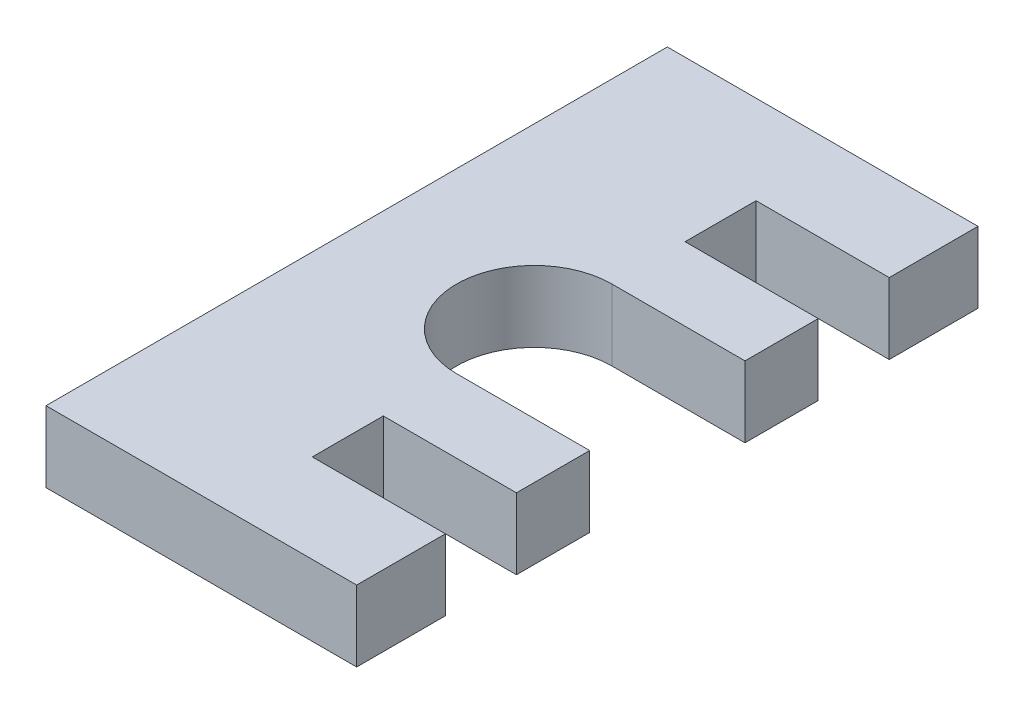
ISO-10303-21;
HEADER;
FILE_DESCRIPTION(('STEP AP214'),'2;1');
FILE_NAME('part.step','',(''),(''),'','','');
FILE_SCHEMA(('AUTOMOTIVE_DESIGN { 1 0 10303 214 1 1 1 1 }'));
ENDSEC;
DATA;
#1=APPLICATION_CONTEXT('core data for automotive mechanical design processes');
#2=APPLICATION_PROTOCOL_DEFINITION('international standard','automotive_design',2000,#1);
#3=PRODUCT_CONTEXT('',#1,'mechanical');
#4=PRODUCT('Part','Part','',(#3));
#5=PRODUCT_RELATED_PRODUCT_CATEGORY('part','',(#4));
#6=PRODUCT_DEFINITION_FORMATION('','',#4);
#7=PRODUCT_DEFINITION_CONTEXT('part definition',#1,'design');
#8=PRODUCT_DEFINITION('design','',#6,#7);
#9=PRODUCT_DEFINITION_SHAPE('','',#8);
#10=(LENGTH_UNIT() NAMED_UNIT(*) SI_UNIT(.MILLI.,.METRE.));
#11=(NAMED_UNIT(*) PLANE_ANGLE_UNIT() SI_UNIT($,.RADIAN.));
#12=(NAMED_UNIT(*) SI_UNIT($,.STERADIAN.) SOLID_ANGLE_UNIT());
#13=UNCERTAINTY_MEASURE_WITH_UNIT(LENGTH_MEASURE(1.E-05),#10,'distance_accuracy_value','');
#14=(GEOMETRIC_REPRESENTATION_CONTEXT(3) GLOBAL_UNCERTAINTY_ASSIGNED_CONTEXT((#13)) GLOBAL_UNIT_ASSIGNED_CONTEXT((#10,
#11,#12)) REPRESENTATION_CONTEXT('',''));
#15=CARTESIAN_POINT('',(0.,0.,0.));
#16=DIRECTION('',(0.,0.,1.));
#17=DIRECTION('',(1.,0.,0.));
#18=AXIS2_PLACEMENT_3D('',#15,#16,#17);
#19=CARTESIAN_POINT('',(22.225,5.08,22.225));
#20=DIRECTION('',(0.,0.,-1.));
#21=DIRECTION('',(-1.,0.,0.));
#22=AXIS2_PLACEMENT_3D('',#19,#20,#21);
#23=PLANE('',#22);
#24=DIRECTION('',(1.,0.,0.));
#25=VECTOR('',#24,1.);
#26=CARTESIAN_POINT('',(22.225,0.,22.225));
#27=LINE('',#26,#25);
#28=CARTESIAN_POINT('',(0.,0.,22.225));
#29=VERTEX_POINT('',#28);
#30=CARTESIAN_POINT('',(22.225,0.,22.225));
#31=VERTEX_POINT('',#30);
#32=EDGE_CURVE('E196',#29,#31,#27,.T.);
#33=ORIENTED_EDGE('',*,*,#32,.T.);
#34=DIRECTION('',(0.,-1.,0.));
#35=VECTOR('',#34,1.);
#36=CARTESIAN_POINT('',(22.225,5.08,22.225));
#37=LINE('',#36,#35);
#38=CARTESIAN_POINT('',(22.225,5.08,22.225));
#39=VERTEX_POINT('',#38);
#40=EDGE_CURVE('E52',#39,#31,#37,.T.);
#41=ORIENTED_EDGE('',*,*,#40,.F.);
#42=DIRECTION('',(1.,0.,0.));
#43=VECTOR('',#42,1.);
#44=CARTESIAN_POINT('',(22.225,5.08,22.225));
#45=LINE('',#44,#43);
#46=CARTESIAN_POINT('',(0.,5.08,22.225));
#47=VERTEX_POINT('',#46);
#48=EDGE_CURVE('E128',#47,#39,#45,.T.);
#49=ORIENTED_EDGE('',*,*,#48,.F.);
#50=DIRECTION('',(0.,-1.,0.));
#51=VECTOR('',#50,1.);
#52=CARTESIAN_POINT('',(0.,5.08,22.225));
#53=LINE('',#52,#51);
#54=EDGE_CURVE('E11',#47,#29,#53,.T.);
#55=ORIENTED_EDGE('',*,*,#54,.T.);
#56=EDGE_LOOP('',(#33,#41,#49,#55));
#57=FACE_BOUND('',#56,.T.);
#58=ADVANCED_FACE('F43',(#57),#23,.F.);
#59=CARTESIAN_POINT('',(22.225,5.08,22.225));
#60=DIRECTION('',(-1.,0.,0.));
#61=DIRECTION('',(0.,0.,1.));
#62=AXIS2_PLACEMENT_3D('',#59,#60,#61);
#63=PLANE('',#62);
#64=DIRECTION('',(0.,0.,-1.));
#65=VECTOR('',#64,1.);
#66=CARTESIAN_POINT('',(22.225,0.,22.225));
#67=LINE('',#66,#65);
#68=CARTESIAN_POINT('',(22.225,0.,15.875));
#69=VERTEX_POINT('',#68);
#70=EDGE_CURVE('E199',#31,#69,#67,.T.);
#71=ORIENTED_EDGE('',*,*,#70,.T.);
#72=DIRECTION('',(0.,-1.,0.));
#73=VECTOR('',#72,1.);
#74=CARTESIAN_POINT('',(22.225,5.08,15.875));
#75=LINE('',#74,#73);
#76=CARTESIAN_POINT('',(22.225,5.08,15.875));
#77=VERTEX_POINT('',#76);
#78=EDGE_CURVE('E283',#77,#69,#75,.T.);
#79=ORIENTED_EDGE('',*,*,#78,.F.);
#80=DIRECTION('',(0.,0.,-1.));
#81=VECTOR('',#80,1.);
#82=CARTESIAN_POINT('',(22.225,5.08,22.225));
#83=LINE('',#82,#81);
#84=EDGE_CURVE('E293',#39,#77,#83,.T.);
#85=ORIENTED_EDGE('',*,*,#84,.F.);
#86=ORIENTED_EDGE('',*,*,#40,.T.);
#87=EDGE_LOOP('',(#71,#79,#85,#86));
#88=FACE_BOUND('',#87,.T.);
#89=ADVANCED_FACE('F291',(#88),#63,.F.);
#90=CARTESIAN_POINT('',(22.225,5.08,15.875));
#91=DIRECTION('',(0.,0.,1.));
#92=DIRECTION('',(1.,0.,0.));
#93=AXIS2_PLACEMENT_3D('',#90,#91,#92);
#94=PLANE('',#93);
#95=DIRECTION('',(-1.,0.,0.));
#96=VECTOR('',#95,1.);
#97=CARTESIAN_POINT('',(22.225,0.,15.875));
#98=LINE('',#97,#96);
#99=CARTESIAN_POINT('',(12.7,0.,15.875));
#100=VERTEX_POINT('',#99);
#101=EDGE_CURVE('E202',#69,#100,#98,.T.);
#102=ORIENTED_EDGE('',*,*,#101,.T.);
#103=DIRECTION('',(0.,-1.,0.));
#104=VECTOR('',#103,1.);
#105=CARTESIAN_POINT('',(12.7,5.08,15.875));
#106=LINE('',#105,#104);
#107=CARTESIAN_POINT('',(12.7,5.08,15.875));
#108=VERTEX_POINT('',#107);
#109=EDGE_CURVE('E279',#108,#100,#106,.T.);
#110=ORIENTED_EDGE('',*,*,#109,.F.);
#111=DIRECTION('',(-1.,0.,0.));
#112=VECTOR('',#111,1.);
#113=CARTESIAN_POINT('',(22.225,5.08,15.875));
#114=LINE('',#113,#112);
#115=EDGE_CURVE('E313',#77,#108,#114,.T.);
#116=ORIENTED_EDGE('',*,*,#115,.F.);
#117=ORIENTED_EDGE('',*,*,#78,.T.);
#118=EDGE_LOOP('',(#102,#110,#116,#117));
#119=FACE_BOUND('',#118,.T.);
#120=ADVANCED_FACE('F303',(#119),#94,.F.);
#121=CARTESIAN_POINT('',(12.7,5.08,15.875));
#122=DIRECTION('',(-1.,0.,0.));
#123=DIRECTION('',(0.,0.,1.));
#124=AXIS2_PLACEMENT_3D('',#121,#122,#123);
#125=PLANE('',#124);
#126=DIRECTION('',(0.,0.,-1.));
#127=VECTOR('',#126,1.);
#128=CARTESIAN_POINT('',(12.7,0.,15.875));
#129=LINE('',#128,#127);
#130=CARTESIAN_POINT('',(12.7,0.,10.795));
#131=VERTEX_POINT('',#130);
#132=EDGE_CURVE('E205',#100,#131,#129,.T.);
#133=ORIENTED_EDGE('',*,*,#132,.T.);
#134=DIRECTION('',(0.,-1.,0.));
#135=VECTOR('',#134,1.);
#136=CARTESIAN_POINT('',(12.7,5.08,10.795));
#137=LINE('',#136,#135);
#138=CARTESIAN_POINT('',(12.7,5.08,10.795));
#139=VERTEX_POINT('',#138);
#140=EDGE_CURVE('E275',#139,#131,#137,.T.);
#141=ORIENTED_EDGE('',*,*,#140,.F.);
#142=DIRECTION('',(0.,0.,-1.));
#143=VECTOR('',#142,1.);
#144=CARTESIAN_POINT('',(12.7,5.08,15.875));
#145=LINE('',#144,#143);
#146=EDGE_CURVE('E309',#108,#139,#145,.T.);
#147=ORIENTED_EDGE('',*,*,#146,.F.);
#148=ORIENTED_EDGE('',*,*,#109,.T.);
#149=EDGE_LOOP('',(#133,#141,#147,#148));
#150=FACE_BOUND('',#149,.T.);
#151=ADVANCED_FACE('F307',(#150),#125,.F.);
#152=CARTESIAN_POINT('',(12.7,5.08,10.795));
#153=DIRECTION('',(0.,0.,-1.));
#154=DIRECTION('',(-1.,0.,0.));
#155=AXIS2_PLACEMENT_3D('',#152,#153,#154);
#156=PLANE('',#155);
#157=DIRECTION('',(1.,0.,0.));
#158=VECTOR('',#157,1.);
#159=CARTESIAN_POINT('',(12.7,0.,10.795));
#160=LINE('',#159,#158);
#161=CARTESIAN_POINT('',(22.225,0.,10.795));
#162=VERTEX_POINT('',#161);
#163=EDGE_CURVE('E208',#131,#162,#160,.T.);
#164=ORIENTED_EDGE('',*,*,#163,.T.);
#165=DIRECTION('',(0.,-1.,0.));
#166=VECTOR('',#165,1.);
#167=CARTESIAN_POINT('',(22.225,5.08,10.795));
#168=LINE('',#167,#166);
#169=CARTESIAN_POINT('',(22.225,5.08,10.795));
#170=VERTEX_POINT('',#169);
#171=EDGE_CURVE('E271',#170,#162,#168,.T.);
#172=ORIENTED_EDGE('',*,*,#171,.F.);
#173=DIRECTION('',(1.,0.,0.));
#174=VECTOR('',#173,1.);
#175=CARTESIAN_POINT('',(12.7,5.08,10.795));
#176=LINE('',#175,#174);
#177=EDGE_CURVE('E312',#139,#170,#176,.T.);
#178=ORIENTED_EDGE('',*,*,#177,.F.);
#179=ORIENTED_EDGE('',*,*,#140,.T.);
#180=EDGE_LOOP('',(#164,#172,#178,#179));
#181=FACE_BOUND('',#180,.T.);
#182=ADVANCED_FACE('F375',(#181),#156,.F.);
#183=CARTESIAN_POINT('',(22.225,5.08,10.795));
#184=DIRECTION('',(-1.,0.,0.));
#185=DIRECTION('',(0.,0.,1.));
#186=AXIS2_PLACEMENT_3D('',#183,#184,#185);
#187=PLANE('',#186);
#188=DIRECTION('',(0.,0.,-1.));
#189=VECTOR('',#188,1.);
#190=CARTESIAN_POINT('',(22.225,0.,10.795));
#191=LINE('',#190,#189);
#192=CARTESIAN_POINT('',(22.225,0.,5.55625));
#193=VERTEX_POINT('',#192);
#194=EDGE_CURVE('E211',#162,#193,#191,.T.);
#195=ORIENTED_EDGE('',*,*,#194,.T.);
#196=DIRECTION('',(0.,-1.,0.));
#197=VECTOR('',#196,1.);
#198=CARTESIAN_POINT('',(22.225,5.08,5.55625));
#199=LINE('',#198,#197);
#200=CARTESIAN_POINT('',(22.225,5.08,5.55625));
#201=VERTEX_POINT('',#200);
#202=EDGE_CURVE('E267',#201,#193,#199,.T.);
#203=ORIENTED_EDGE('',*,*,#202,.F.);
#204=DIRECTION('',(0.,0.,-1.));
#205=VECTOR('',#204,1.);
#206=CARTESIAN_POINT('',(22.225,5.08,10.795));
#207=LINE('',#206,#205);
#208=EDGE_CURVE('E317',#170,#201,#207,.T.);
#209=ORIENTED_EDGE('',*,*,#208,.F.);
#210=ORIENTED_EDGE('',*,*,#171,.T.);
#211=EDGE_LOOP('',(#195,#203,#209,#210));
#212=FACE_BOUND('',#211,.T.);
#213=ADVANCED_FACE('F378',(#212),#187,.F.);
#214=CARTESIAN_POINT('',(22.225,5.08,5.55625));
#215=DIRECTION('',(0.,0.,1.));
#216=DIRECTION('',(1.,0.,0.));
#217=AXIS2_PLACEMENT_3D('',#214,#215,#216);
#218=PLANE('',#217);
#219=DIRECTION('',(-1.,0.,0.));
#220=VECTOR('',#219,1.);
#221=CARTESIAN_POINT('',(22.225,0.,5.55625));
#222=LINE('',#221,#220);
#223=CARTESIAN_POINT('',(12.7,0.,5.55625));
#224=VERTEX_POINT('',#223);
#225=EDGE_CURVE('E214',#193,#224,#222,.T.);
#226=ORIENTED_EDGE('',*,*,#225,.T.);
#227=DIRECTION('',(0.,-1.,0.));
#228=VECTOR('',#227,1.);
#229=CARTESIAN_POINT('',(12.7,5.08,5.55625));
#230=LINE('',#229,#228);
#231=CARTESIAN_POINT('',(12.7,5.08,5.55625));
#232=VERTEX_POINT('',#231);
#233=EDGE_CURVE('E263',#232,#224,#230,.T.);
#234=ORIENTED_EDGE('',*,*,#233,.F.);
#235=DIRECTION('',(-1.,0.,0.));
#236=VECTOR('',#235,1.);
#237=CARTESIAN_POINT('',(22.225,5.08,5.55625));
#238=LINE('',#237,#236);
#239=EDGE_CURVE('E324',#201,#232,#238,.T.);
#240=ORIENTED_EDGE('',*,*,#239,.F.);
#241=ORIENTED_EDGE('',*,*,#202,.T.);
#242=EDGE_LOOP('',(#226,#234,#240,#241));
#243=FACE_BOUND('',#242,.T.);
#244=ADVANCED_FACE('F382',(#243),#218,.F.);
#245=CARTESIAN_POINT('',(12.7,5.08,0.));
#246=DIRECTION('',(0.,-1.,0.));
#247=DIRECTION('',(0.,0.,-1.));
#248=AXIS2_PLACEMENT_3D('',#245,#246,#247);
#249=CYLINDRICAL_SURFACE('',#248,5.55625);
#250=CARTESIAN_POINT('',(12.7,0.,0.));
#251=DIRECTION('',(0.,-1.,0.));
#252=DIRECTION('',(0.,0.,1.));
#253=AXIS2_PLACEMENT_3D('',#250,#251,#252);
#254=CIRCLE('',#253,5.55625);
#255=CARTESIAN_POINT('',(12.7,0.,-5.55625));
#256=VERTEX_POINT('',#255);
#257=EDGE_CURVE('E217',#224,#256,#254,.T.);
#258=ORIENTED_EDGE('',*,*,#257,.T.);
#259=DIRECTION('',(0.,-1.,0.));
#260=VECTOR('',#259,1.);
#261=CARTESIAN_POINT('',(12.7,5.08,-5.55625));
#262=LINE('',#261,#260);
#263=CARTESIAN_POINT('',(12.7,5.08,-5.55625));
#264=VERTEX_POINT('',#263);
#265=EDGE_CURVE('E259',#264,#256,#262,.T.);
#266=ORIENTED_EDGE('',*,*,#265,.F.);
#267=CARTESIAN_POINT('',(12.7,5.08,0.));
#268=DIRECTION('',(0.,-1.,0.));
#269=DIRECTION('',(0.,0.,1.));
#270=AXIS2_PLACEMENT_3D('',#267,#268,#269);
#271=CIRCLE('',#270,5.55625);
#272=EDGE_CURVE('E327',#232,#264,#271,.T.);
#273=ORIENTED_EDGE('',*,*,#272,.F.);
#274=ORIENTED_EDGE('',*,*,#233,.T.);
#275=EDGE_LOOP('',(#258,#266,#273,#274));
#276=FACE_BOUND('',#275,.T.);
#277=ADVANCED_FACE('F386',(#276),#249,.F.);
#278=CARTESIAN_POINT('',(22.225,5.08,-5.55625));
#279=DIRECTION('',(0.,0.,-1.));
#280=DIRECTION('',(-1.,0.,0.));
#281=AXIS2_PLACEMENT_3D('',#278,#279,#280);
#282=PLANE('',#281);
#283=DIRECTION('',(1.,0.,0.));
#284=VECTOR('',#283,1.);
#285=CARTESIAN_POINT('',(22.225,0.,-5.55625));
#286=LINE('',#285,#284);
#287=CARTESIAN_POINT('',(22.225,0.,-5.55625));
#288=VERTEX_POINT('',#287);
#289=EDGE_CURVE('E220',#256,#288,#286,.T.);
#290=ORIENTED_EDGE('',*,*,#289,.T.);
#291=DIRECTION('',(0.,-1.,0.));
#292=VECTOR('',#291,1.);
#293=CARTESIAN_POINT('',(22.225,5.08,-5.55625));
#294=LINE('',#293,#292);
#295=CARTESIAN_POINT('',(22.225,5.08,-5.55625));
#296=VERTEX_POINT('',#295);
#297=EDGE_CURVE('E255',#296,#288,#294,.T.);
#298=ORIENTED_EDGE('',*,*,#297,.F.);
#299=DIRECTION('',(1.,0.,0.));
#300=VECTOR('',#299,1.);
#301=CARTESIAN_POINT('',(22.225,5.08,-5.55625));
#302=LINE('',#301,#300);
#303=EDGE_CURVE('E330',#264,#296,#302,.T.);
#304=ORIENTED_EDGE('',*,*,#303,.F.);
#305=ORIENTED_EDGE('',*,*,#265,.T.);
#306=EDGE_LOOP('',(#290,#298,#304,#305));
#307=FACE_BOUND('',#306,.T.);
#308=ADVANCED_FACE('F390',(#307),#282,.F.);
#309=CARTESIAN_POINT('',(22.225,5.08,-10.795));
#310=DIRECTION('',(-1.,0.,0.));
#311=DIRECTION('',(0.,0.,1.));
#312=AXIS2_PLACEMENT_3D('',#309,#310,#311);
#313=PLANE('',#312);
#314=DIRECTION('',(0.,0.,-1.));
#315=VECTOR('',#314,1.);
#316=CARTESIAN_POINT('',(22.225,0.,-10.795));
#317=LINE('',#316,#315);
#318=CARTESIAN_POINT('',(22.225,0.,-10.795));
#319=VERTEX_POINT('',#318);
#320=EDGE_CURVE('E223',#288,#319,#317,.T.);
#321=ORIENTED_EDGE('',*,*,#320,.T.);
#322=DIRECTION('',(0.,-1.,0.));
#323=VECTOR('',#322,1.);
#324=CARTESIAN_POINT('',(22.225,5.08,-10.795));
#325=LINE('',#324,#323);
#326=CARTESIAN_POINT('',(22.225,5.08,-10.795));
#327=VERTEX_POINT('',#326);
#328=EDGE_CURVE('E251',#327,#319,#325,.T.);
#329=ORIENTED_EDGE('',*,*,#328,.F.);
#330=DIRECTION('',(0.,0.,-1.));
#331=VECTOR('',#330,1.);
#332=CARTESIAN_POINT('',(22.225,5.08,-10.795));
#333=LINE('',#332,#331);
#334=EDGE_CURVE('E333',#296,#327,#333,.T.);
#335=ORIENTED_EDGE('',*,*,#334,.F.);
#336=ORIENTED_EDGE('',*,*,#297,.T.);
#337=EDGE_LOOP('',(#321,#329,#335,#336));
#338=FACE_BOUND('',#337,.T.);
#339=ADVANCED_FACE('F394',(#338),#313,.F.);
#340=CARTESIAN_POINT('',(12.7,5.08,-10.795));
#341=DIRECTION('',(0.,0.,1.));
#342=DIRECTION('',(1.,0.,0.));
#343=AXIS2_PLACEMENT_3D('',#340,#341,#342);
#344=PLANE('',#343);
#345=DIRECTION('',(-1.,0.,0.));
#346=VECTOR('',#345,1.);
#347=CARTESIAN_POINT('',(12.7,0.,-10.795));
#348=LINE('',#347,#346);
#349=CARTESIAN_POINT('',(12.7,0.,-10.795));
#350=VERTEX_POINT('',#349);
#351=EDGE_CURVE('E226',#319,#350,#348,.T.);
#352=ORIENTED_EDGE('',*,*,#351,.T.);
#353=DIRECTION('',(0.,-1.,0.));
#354=VECTOR('',#353,1.);
#355=CARTESIAN_POINT('',(12.7,5.08,-10.795));
#356=LINE('',#355,#354);
#357=CARTESIAN_POINT('',(12.7,5.08,-10.795));
#358=VERTEX_POINT('',#357);
#359=EDGE_CURVE('E247',#358,#350,#356,.T.);
#360=ORIENTED_EDGE('',*,*,#359,.F.);
#361=DIRECTION('',(-1.,0.,0.));
#362=VECTOR('',#361,1.);
#363=CARTESIAN_POINT('',(12.7,5.08,-10.795));
#364=LINE('',#363,#362);
#365=EDGE_CURVE('E336',#327,#358,#364,.T.);
#366=ORIENTED_EDGE('',*,*,#365,.F.);
#367=ORIENTED_EDGE('',*,*,#328,.T.);
#368=EDGE_LOOP('',(#352,#360,#366,#367));
#369=FACE_BOUND('',#368,.T.);
#370=ADVANCED_FACE('F344',(#369),#344,.F.);
#371=CARTESIAN_POINT('',(12.7,5.08,-15.875));
#372=DIRECTION('',(-1.,0.,0.));
#373=DIRECTION('',(0.,0.,1.));
#374=AXIS2_PLACEMENT_3D('',#371,#372,#373);
#375=PLANE('',#374);
#376=DIRECTION('',(0.,0.,-1.));
#377=VECTOR('',#376,1.);
#378=CARTESIAN_POINT('',(12.7,0.,-15.875));
#379=LINE('',#378,#377);
#380=CARTESIAN_POINT('',(12.7,0.,-15.875));
#381=VERTEX_POINT('',#380);
#382=EDGE_CURVE('E229',#350,#381,#379,.T.);
#383=ORIENTED_EDGE('',*,*,#382,.T.);
#384=DIRECTION('',(0.,-1.,0.));
#385=VECTOR('',#384,1.);
#386=CARTESIAN_POINT('',(12.7,5.08,-15.875));
#387=LINE('',#386,#385);
#388=CARTESIAN_POINT('',(12.7,5.08,-15.875));
#389=VERTEX_POINT('',#388);
#390=EDGE_CURVE('E183',#389,#381,#387,.T.);
#391=ORIENTED_EDGE('',*,*,#390,.F.);
#392=DIRECTION('',(0.,0.,-1.));
#393=VECTOR('',#392,1.);
#394=CARTESIAN_POINT('',(12.7,5.08,-15.875));
#395=LINE('',#394,#393);
#396=EDGE_CURVE('E172',#358,#389,#395,.T.);
#397=ORIENTED_EDGE('',*,*,#396,.F.);
#398=ORIENTED_EDGE('',*,*,#359,.T.);
#399=EDGE_LOOP('',(#383,#391,#397,#398));
#400=FACE_BOUND('',#399,.T.);
#401=ADVANCED_FACE('F348',(#400),#375,.F.);
#402=CARTESIAN_POINT('',(22.225,5.08,-15.875));
#403=DIRECTION('',(0.,0.,-1.));
#404=DIRECTION('',(-1.,0.,0.));
#405=AXIS2_PLACEMENT_3D('',#402,#403,#404);
#406=PLANE('',#405);
#407=DIRECTION('',(1.,0.,0.));
#408=VECTOR('',#407,1.);
#409=CARTESIAN_POINT('',(22.225,0.,-15.875));
#410=LINE('',#409,#408);
#411=CARTESIAN_POINT('',(22.225,0.,-15.875));
#412=VERTEX_POINT('',#411);
#413=EDGE_CURVE('E181',#381,#412,#410,.T.);
#414=ORIENTED_EDGE('',*,*,#413,.T.);
#415=DIRECTION('',(0.,-1.,0.));
#416=VECTOR('',#415,1.);
#417=CARTESIAN_POINT('',(22.225,5.08,-15.875));
#418=LINE('',#417,#416);
#419=CARTESIAN_POINT('',(22.225,5.08,-15.875));
#420=VERTEX_POINT('',#419);
#421=EDGE_CURVE('E178',#420,#412,#418,.T.);
#422=ORIENTED_EDGE('',*,*,#421,.F.);
#423=DIRECTION('',(1.,0.,0.));
#424=VECTOR('',#423,1.);
#425=CARTESIAN_POINT('',(22.225,5.08,-15.875));
#426=LINE('',#425,#424);
#427=EDGE_CURVE('E166',#389,#420,#426,.T.);
#428=ORIENTED_EDGE('',*,*,#427,.F.);
#429=ORIENTED_EDGE('',*,*,#390,.T.);
#430=EDGE_LOOP('',(#414,#422,#428,#429));
#431=FACE_BOUND('',#430,.T.);
#432=ADVANCED_FACE('F179',(#431),#406,.F.);
#433=CARTESIAN_POINT('',(22.225,5.08,-22.225));
#434=DIRECTION('',(-1.,0.,0.));
#435=DIRECTION('',(0.,0.,1.));
#436=AXIS2_PLACEMENT_3D('',#433,#434,#435);
#437=PLANE('',#436);
#438=DIRECTION('',(0.,0.,-1.));
#439=VECTOR('',#438,1.);
#440=CARTESIAN_POINT('',(22.225,0.,-22.225));
#441=LINE('',#440,#439);
#442=CARTESIAN_POINT('',(22.225,0.,-22.225));
#443=VERTEX_POINT('',#442);
#444=EDGE_CURVE('E114',#412,#443,#441,.T.);
#445=ORIENTED_EDGE('',*,*,#444,.T.);
#446=DIRECTION('',(0.,-1.,0.));
#447=VECTOR('',#446,1.);
#448=CARTESIAN_POINT('',(22.225,5.08,-22.225));
#449=LINE('',#448,#447);
#450=CARTESIAN_POINT('',(22.225,5.08,-22.225));
#451=VERTEX_POINT('',#450);
#452=EDGE_CURVE('E184',#451,#443,#449,.T.);
#453=ORIENTED_EDGE('',*,*,#452,.F.);
#454=DIRECTION('',(0.,0.,-1.));
#455=VECTOR('',#454,1.);
#456=CARTESIAN_POINT('',(22.225,5.08,-22.225));
#457=LINE('',#456,#455);
#458=EDGE_CURVE('E170',#420,#451,#457,.T.);
#459=ORIENTED_EDGE('',*,*,#458,.F.);
#460=ORIENTED_EDGE('',*,*,#421,.T.);
#461=EDGE_LOOP('',(#445,#453,#459,#460));
#462=FACE_BOUND('',#461,.T.);
#463=ADVANCED_FACE('F186',(#462),#437,.F.);
#464=CARTESIAN_POINT('',(0.,5.08,-22.225));
#465=DIRECTION('',(0.,0.,1.));
#466=DIRECTION('',(1.,0.,0.));
#467=AXIS2_PLACEMENT_3D('',#464,#465,#466);
#468=PLANE('',#467);
#469=DIRECTION('',(-1.,0.,0.));
#470=VECTOR('',#469,1.);
#471=CARTESIAN_POINT('',(0.,0.,-22.225));
#472=LINE('',#471,#470);
#473=CARTESIAN_POINT('',(0.,0.,-22.225));
#474=VERTEX_POINT('',#473);
#475=EDGE_CURVE('E121',#443,#474,#472,.T.);
#476=ORIENTED_EDGE('',*,*,#475,.T.);
#477=DIRECTION('',(0.,-1.,0.));
#478=VECTOR('',#477,1.);
#479=CARTESIAN_POINT('',(0.,5.08,-22.225));
#480=LINE('',#479,#478);
#481=CARTESIAN_POINT('',(0.,5.08,-22.225));
#482=VERTEX_POINT('',#481);
#483=EDGE_CURVE('E192',#482,#474,#480,.T.);
#484=ORIENTED_EDGE('',*,*,#483,.F.);
#485=DIRECTION('',(-1.,0.,0.));
#486=VECTOR('',#485,1.);
#487=CARTESIAN_POINT('',(0.,5.08,-22.225));
#488=LINE('',#487,#486);
#489=EDGE_CURVE('E189',#451,#482,#488,.T.);
#490=ORIENTED_EDGE('',*,*,#489,.F.);
#491=ORIENTED_EDGE('',*,*,#452,.T.);
#492=EDGE_LOOP('',(#476,#484,#490,#491));
#493=FACE_BOUND('',#492,.T.);
#494=ADVANCED_FACE('F350',(#493),#468,.F.);
#495=CARTESIAN_POINT('',(0.,5.08,0.));
#496=DIRECTION('',(1.,0.,0.));
#497=DIRECTION('',(0.,0.,-1.));
#498=AXIS2_PLACEMENT_3D('',#495,#496,#497);
#499=PLANE('',#498);
#500=DIRECTION('',(0.,0.,1.));
#501=VECTOR('',#500,1.);
#502=CARTESIAN_POINT('',(0.,0.,0.));
#503=LINE('',#502,#501);
#504=EDGE_CURVE('E238',#474,#29,#503,.T.);
#505=ORIENTED_EDGE('',*,*,#504,.T.);
#506=ORIENTED_EDGE('',*,*,#54,.F.);
#507=DIRECTION('',(0.,0.,1.));
#508=VECTOR('',#507,1.);
#509=CARTESIAN_POINT('',(0.,5.08,22.225));
#510=LINE('',#509,#508);
#511=EDGE_CURVE('E60',#482,#47,#510,.T.);
#512=ORIENTED_EDGE('',*,*,#511,.F.);
#513=ORIENTED_EDGE('',*,*,#483,.T.);
#514=EDGE_LOOP('',(#505,#506,#512,#513));
#515=FACE_BOUND('',#514,.T.);
#516=ADVANCED_FACE('F349',(#515),#499,.F.);
#517=CARTESIAN_POINT('',(12.7,5.08,0.));
#518=DIRECTION('',(0.,1.,0.));
#519=DIRECTION('',(0.,0.,1.));
#520=AXIS2_PLACEMENT_3D('',#517,#518,#519);
#521=PLANE('',#520);
#522=ORIENTED_EDGE('',*,*,#511,.T.);
#523=ORIENTED_EDGE('',*,*,#48,.T.);
#524=ORIENTED_EDGE('',*,*,#84,.T.);
#525=ORIENTED_EDGE('',*,*,#115,.T.);
#526=ORIENTED_EDGE('',*,*,#146,.T.);
#527=ORIENTED_EDGE('',*,*,#177,.T.);
#528=ORIENTED_EDGE('',*,*,#208,.T.);
#529=ORIENTED_EDGE('',*,*,#239,.T.);
#530=ORIENTED_EDGE('',*,*,#272,.T.);
#531=ORIENTED_EDGE('',*,*,#303,.T.);
#532=ORIENTED_EDGE('',*,*,#334,.T.);
#533=ORIENTED_EDGE('',*,*,#365,.T.);
#534=ORIENTED_EDGE('',*,*,#396,.T.);
#535=ORIENTED_EDGE('',*,*,#427,.T.);
#536=ORIENTED_EDGE('',*,*,#458,.T.);
#537=ORIENTED_EDGE('',*,*,#489,.T.);
#538=EDGE_LOOP('',(#522,#523,#524,#525,#526,#527,#528,#529,#530,#531,#532,#533,#534,#535,#536,#537));
#539=FACE_BOUND('',#538,.T.);
#540=ADVANCED_FACE('F168',(#539),#521,.T.);
#541=CARTESIAN_POINT('',(12.7,0.,0.));
#542=DIRECTION('',(0.,1.,0.));
#543=DIRECTION('',(0.,0.,1.));
#544=AXIS2_PLACEMENT_3D('',#541,#542,#543);
#545=PLANE('',#544);
#546=ORIENTED_EDGE('',*,*,#32,.F.);
#547=ORIENTED_EDGE('',*,*,#504,.F.);
#548=ORIENTED_EDGE('',*,*,#475,.F.);
#549=ORIENTED_EDGE('',*,*,#444,.F.);
#550=ORIENTED_EDGE('',*,*,#413,.F.);
#551=ORIENTED_EDGE('',*,*,#382,.F.);
#552=ORIENTED_EDGE('',*,*,#351,.F.);
#553=ORIENTED_EDGE('',*,*,#320,.F.);
#554=ORIENTED_EDGE('',*,*,#289,.F.);
#555=ORIENTED_EDGE('',*,*,#257,.F.);
#556=ORIENTED_EDGE('',*,*,#225,.F.);
#557=ORIENTED_EDGE('',*,*,#194,.F.);
#558=ORIENTED_EDGE('',*,*,#163,.F.);
#559=ORIENTED_EDGE('',*,*,#132,.F.);
#560=ORIENTED_EDGE('',*,*,#101,.F.);
#561=ORIENTED_EDGE('',*,*,#70,.F.);
#562=EDGE_LOOP('',(#546,#547,#548,#549,#550,#551,#552,#553,#554,#555,#556,#557,#558,#559,#560,#561));
#563=FACE_BOUND('',#562,.T.);
#564=ADVANCED_FACE('F297',(#563),#545,.F.);
#565=CLOSED_SHELL('',(#58,#89,#120,#151,#182,#213,#244,#277,#308,#339,#370,#401,#432,#463,#494,
#516,#540,#564));
#566=MANIFOLD_SOLID_BREP('B2',#565);
#567=ADVANCED_BREP_SHAPE_REPRESENTATION('',(#18,#566),#14);
#568=SHAPE_DEFINITION_REPRESENTATION(#9,#567);
ENDSEC;
END-ISO-10303-21;
